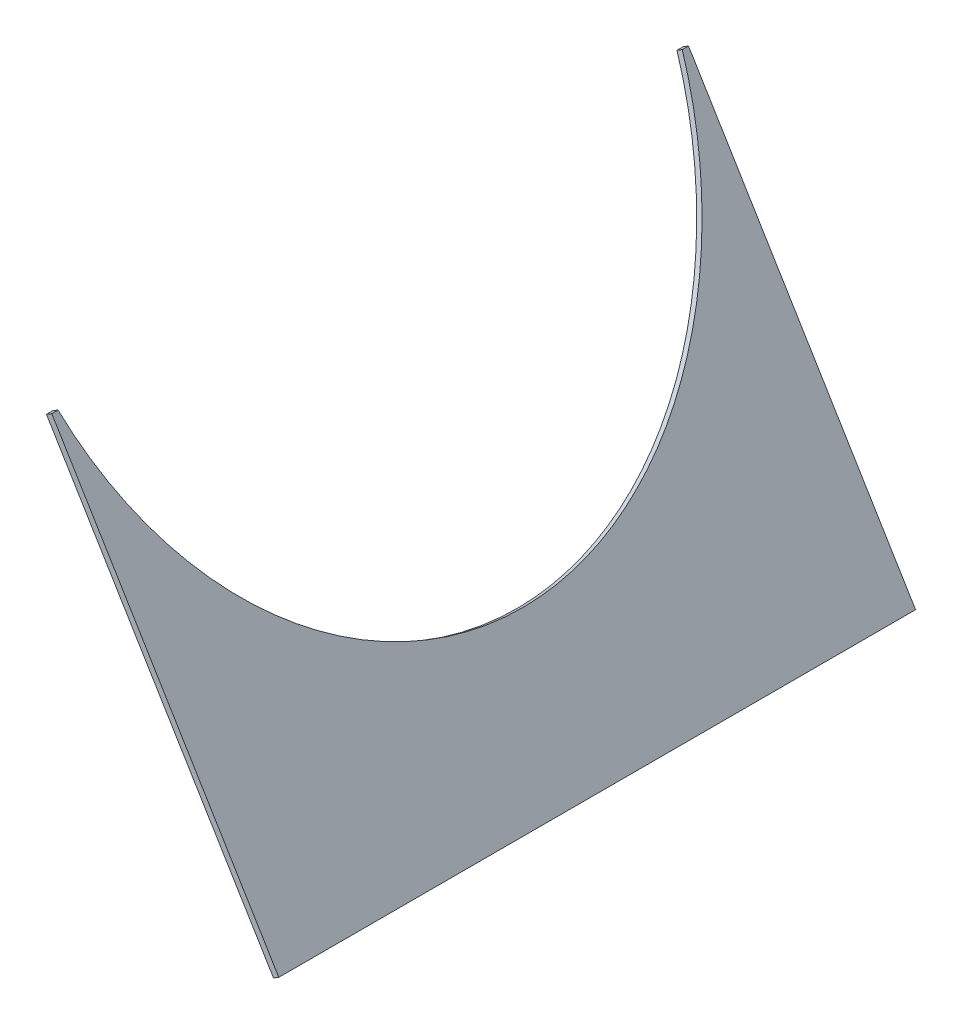
ISO-10303-21;
HEADER;
FILE_DESCRIPTION(('STEP AP214'),'2;1');
FILE_NAME('part.step','',(''),(''),'','','');
FILE_SCHEMA(('AUTOMOTIVE_DESIGN { 1 0 10303 214 1 1 1 1 }'));
ENDSEC;
DATA;
#1=APPLICATION_CONTEXT('core data for automotive mechanical design processes');
#2=APPLICATION_PROTOCOL_DEFINITION('international standard','automotive_design',2000,#1);
#3=PRODUCT_CONTEXT('',#1,'mechanical');
#4=PRODUCT('Part','Part','',(#3));
#5=PRODUCT_RELATED_PRODUCT_CATEGORY('part','',(#4));
#6=PRODUCT_DEFINITION_FORMATION('','',#4);
#7=PRODUCT_DEFINITION_CONTEXT('part definition',#1,'design');
#8=PRODUCT_DEFINITION('design','',#6,#7);
#9=PRODUCT_DEFINITION_SHAPE('','',#8);
#10=(LENGTH_UNIT() NAMED_UNIT(*) SI_UNIT(.MILLI.,.METRE.));
#11=(NAMED_UNIT(*) PLANE_ANGLE_UNIT() SI_UNIT($,.RADIAN.));
#12=(NAMED_UNIT(*) SI_UNIT($,.STERADIAN.) SOLID_ANGLE_UNIT());
#13=UNCERTAINTY_MEASURE_WITH_UNIT(LENGTH_MEASURE(1.E-05),#10,'distance_accuracy_value','');
#14=(GEOMETRIC_REPRESENTATION_CONTEXT(3) GLOBAL_UNCERTAINTY_ASSIGNED_CONTEXT((#13)) GLOBAL_UNIT_ASSIGNED_CONTEXT((#10,
#11,#12)) REPRESENTATION_CONTEXT('',''));
#15=CARTESIAN_POINT('',(0.,0.,0.));
#16=DIRECTION('',(0.,0.,1.));
#17=DIRECTION('',(1.,0.,0.));
#18=AXIS2_PLACEMENT_3D('',#15,#16,#17);
#19=CARTESIAN_POINT('',(1720.07227654078,3061.15984817426,102.));
#20=DIRECTION('',(-0.855234381676339,-0.518241403593624,0.));
#21=DIRECTION('',(0.518241403593624,-0.855234381676339,0.));
#22=AXIS2_PLACEMENT_3D('',#19,#20,#21);
#23=PLANE('',#22);
#24=DIRECTION('',(0.,0.,1.));
#25=VECTOR('',#24,1.);
#26=CARTESIAN_POINT('',(1647.33485727931,3181.19568737091,102.));
#27=LINE('',#26,#25);
#28=CARTESIAN_POINT('',(1647.33485727931,3181.19568737091,-102.));
#29=VERTEX_POINT('',#28);
#30=CARTESIAN_POINT('',(1647.33485727931,3181.19568737091,-100.));
#31=VERTEX_POINT('',#30);
#32=EDGE_CURVE('E59',#29,#31,#27,.T.);
#33=ORIENTED_EDGE('',*,*,#32,.T.);
#34=CARTESIAN_POINT('',(1633.6171020045,3203.8335852098,0.));
#35=DIRECTION('',(-0.855234381676339,-0.518241403593624,0.));
#36=DIRECTION('',(-0.518241403593624,0.855234381676339,0.));
#37=AXIS2_PLACEMENT_3D('',#34,#35,#36);
#38=ELLIPSE('',#37,120.584723294107,102.5);
#39=CARTESIAN_POINT('',(1647.33485727931,3181.19568737091,100.));
#40=VERTEX_POINT('',#39);
#41=EDGE_CURVE('E66',#31,#40,#38,.T.);
#42=ORIENTED_EDGE('',*,*,#41,.T.);
#43=DIRECTION('',(0.,0.,1.));
#44=VECTOR('',#43,1.);
#45=CARTESIAN_POINT('',(1647.33485727931,3181.19568737091,102.));
#46=LINE('',#45,#44);
#47=CARTESIAN_POINT('',(1647.33485727931,3181.19568737091,102.));
#48=VERTEX_POINT('',#47);
#49=EDGE_CURVE('E159',#40,#48,#46,.T.);
#50=ORIENTED_EDGE('',*,*,#49,.T.);
#51=DIRECTION('',(-0.518241403593624,0.855234381676339,0.));
#52=VECTOR('',#51,1.);
#53=CARTESIAN_POINT('',(1720.07227654078,3061.15984817426,102.));
#54=LINE('',#53,#52);
#55=CARTESIAN_POINT('',(1720.07227654078,3061.15984817426,102.));
#56=VERTEX_POINT('',#55);
#57=EDGE_CURVE('E128',#56,#48,#54,.T.);
#58=ORIENTED_EDGE('',*,*,#57,.F.);
#59=DIRECTION('',(0.,0.,-1.));
#60=VECTOR('',#59,1.);
#61=CARTESIAN_POINT('',(1720.07227654078,3061.15984817426,102.));
#62=LINE('',#61,#60);
#63=CARTESIAN_POINT('',(1720.07227654078,3061.15984817426,-102.));
#64=VERTEX_POINT('',#63);
#65=EDGE_CURVE('E51',#56,#64,#62,.T.);
#66=ORIENTED_EDGE('',*,*,#65,.T.);
#67=DIRECTION('',(-0.518241403593624,0.855234381676339,0.));
#68=VECTOR('',#67,1.);
#69=CARTESIAN_POINT('',(1720.07227654078,3061.15984817426,-102.));
#70=LINE('',#69,#68);
#71=EDGE_CURVE('E106',#64,#29,#70,.T.);
#72=ORIENTED_EDGE('',*,*,#71,.T.);
#73=EDGE_LOOP('',(#33,#42,#50,#58,#66,#72));
#74=FACE_BOUND('',#73,.T.);
#75=ADVANCED_FACE('F43',(#74),#23,.F.);
#76=CARTESIAN_POINT('',(1718.36180777742,3060.12336536707,102.));
#77=DIRECTION('',(-0.855234381676339,-0.518241403593624,0.));
#78=DIRECTION('',(0.518241403593624,-0.855234381676339,0.));
#79=AXIS2_PLACEMENT_3D('',#76,#77,#78);
#80=PLANE('',#79);
#81=CARTESIAN_POINT('',(1631.90663324115,3202.79710240262,0.));
#82=DIRECTION('',(-0.855234381676339,-0.518241403593624,0.));
#83=DIRECTION('',(-0.518241403593624,0.855234381676339,0.));
#84=AXIS2_PLACEMENT_3D('',#81,#82,#83);
#85=ELLIPSE('',#84,120.584723294107,102.5);
#86=CARTESIAN_POINT('',(1645.62438851596,3180.15920456373,-100.));
#87=VERTEX_POINT('',#86);
#88=CARTESIAN_POINT('',(1645.62438851596,3180.15920456373,100.));
#89=VERTEX_POINT('',#88);
#90=EDGE_CURVE('E111',#87,#89,#85,.T.);
#91=ORIENTED_EDGE('',*,*,#90,.F.);
#92=DIRECTION('',(0.,0.,1.));
#93=VECTOR('',#92,1.);
#94=CARTESIAN_POINT('',(1645.62438851596,3180.15920456373,102.));
#95=LINE('',#94,#93);
#96=CARTESIAN_POINT('',(1645.62438851596,3180.15920456373,-102.));
#97=VERTEX_POINT('',#96);
#98=EDGE_CURVE('E98',#97,#87,#95,.T.);
#99=ORIENTED_EDGE('',*,*,#98,.F.);
#100=DIRECTION('',(-0.518241403593624,0.855234381676339,0.));
#101=VECTOR('',#100,1.);
#102=CARTESIAN_POINT('',(1718.36180777742,3060.12336536707,-102.));
#103=LINE('',#102,#101);
#104=CARTESIAN_POINT('',(1718.36180777742,3060.12336536707,-102.));
#105=VERTEX_POINT('',#104);
#106=EDGE_CURVE('E113',#105,#97,#103,.T.);
#107=ORIENTED_EDGE('',*,*,#106,.F.);
#108=DIRECTION('',(0.,0.,-1.));
#109=VECTOR('',#108,1.);
#110=CARTESIAN_POINT('',(1718.36180777742,3060.12336536707,102.));
#111=LINE('',#110,#109);
#112=CARTESIAN_POINT('',(1718.36180777742,3060.12336536707,102.));
#113=VERTEX_POINT('',#112);
#114=EDGE_CURVE('E11',#113,#105,#111,.T.);
#115=ORIENTED_EDGE('',*,*,#114,.F.);
#116=DIRECTION('',(-0.518241403593624,0.855234381676339,0.));
#117=VECTOR('',#116,1.);
#118=CARTESIAN_POINT('',(1718.36180777742,3060.12336536707,102.));
#119=LINE('',#118,#117);
#120=CARTESIAN_POINT('',(1645.62438851596,3180.15920456373,102.));
#121=VERTEX_POINT('',#120);
#122=EDGE_CURVE('E182',#113,#121,#119,.T.);
#123=ORIENTED_EDGE('',*,*,#122,.T.);
#124=DIRECTION('',(0.,0.,1.));
#125=VECTOR('',#124,1.);
#126=CARTESIAN_POINT('',(1645.62438851596,3180.15920456373,102.));
#127=LINE('',#126,#125);
#128=EDGE_CURVE('E101',#89,#121,#127,.T.);
#129=ORIENTED_EDGE('',*,*,#128,.F.);
#130=EDGE_LOOP('',(#91,#99,#107,#115,#123,#129));
#131=FACE_BOUND('',#130,.T.);
#132=ADVANCED_FACE('F135',(#131),#80,.T.);
#133=CARTESIAN_POINT('',(1631.90663324115,3202.79710240262,0.));
#134=DIRECTION('',(-0.855234381676339,-0.518241403593624,0.));
#135=DIRECTION('',(-0.518241403593624,0.855234381676339,0.));
#136=AXIS2_PLACEMENT_3D('',#133,#134,#135);
#137=ELLIPSE('',#136,120.584723294107,102.5);
#138=DIRECTION('',(-0.855234381676339,-0.518241403593624,0.));
#139=VECTOR('',#138,1.);
#140=SURFACE_OF_LINEAR_EXTRUSION('',#137,#139);
#141=ORIENTED_EDGE('',*,*,#41,.F.);
#142=DIRECTION('',(-0.855234381676339,-0.518241403593624,0.));
#143=VECTOR('',#142,1.);
#144=CARTESIAN_POINT('',(1645.62438851596,3180.15920456373,-100.));
#145=LINE('',#144,#143);
#146=EDGE_CURVE('E95',#87,#31,#145,.F.);
#147=ORIENTED_EDGE('',*,*,#146,.F.);
#148=ORIENTED_EDGE('',*,*,#90,.T.);
#149=DIRECTION('',(-0.855234381676339,-0.518241403593624,0.));
#150=VECTOR('',#149,1.);
#151=CARTESIAN_POINT('',(1645.62438851596,3180.15920456373,100.));
#152=LINE('',#151,#150);
#153=EDGE_CURVE('E110',#89,#40,#152,.F.);
#154=ORIENTED_EDGE('',*,*,#153,.T.);
#155=EDGE_LOOP('',(#141,#147,#148,#154));
#156=FACE_BOUND('',#155,.T.);
#157=ADVANCED_FACE('F108',(#156),#140,.F.);
#158=CARTESIAN_POINT('',(0.,0.,-102.));
#159=DIRECTION('',(0.,0.,-1.));
#160=DIRECTION('',(-1.,0.,0.));
#161=AXIS2_PLACEMENT_3D('',#158,#159,#160);
#162=PLANE('',#161);
#163=ORIENTED_EDGE('',*,*,#106,.T.);
#164=DIRECTION('',(-0.855234381676339,-0.518241403593624,0.));
#165=VECTOR('',#164,1.);
#166=CARTESIAN_POINT('',(1645.62438851596,3180.15920456373,-102.));
#167=LINE('',#166,#165);
#168=EDGE_CURVE('E102',#97,#29,#167,.F.);
#169=ORIENTED_EDGE('',*,*,#168,.T.);
#170=ORIENTED_EDGE('',*,*,#71,.F.);
#171=DIRECTION('',(-0.85523438167636,-0.51824140359359,0.));
#172=VECTOR('',#171,1.);
#173=CARTESIAN_POINT('',(1720.07227654078,3061.15984817426,-102.));
#174=LINE('',#173,#172);
#175=EDGE_CURVE('E173',#64,#105,#174,.T.);
#176=ORIENTED_EDGE('',*,*,#175,.T.);
#177=EDGE_LOOP('',(#163,#169,#170,#176));
#178=FACE_BOUND('',#177,.T.);
#179=ADVANCED_FACE('F134',(#178),#162,.T.);
#180=CARTESIAN_POINT('',(0.,0.,102.));
#181=DIRECTION('',(0.,0.,-1.));
#182=DIRECTION('',(-1.,0.,0.));
#183=AXIS2_PLACEMENT_3D('',#180,#181,#182);
#184=PLANE('',#183);
#185=DIRECTION('',(-0.855234381676339,-0.518241403593624,0.));
#186=VECTOR('',#185,1.);
#187=CARTESIAN_POINT('',(1645.62438851596,3180.15920456373,102.));
#188=LINE('',#187,#186);
#189=EDGE_CURVE('E115',#121,#48,#188,.F.);
#190=ORIENTED_EDGE('',*,*,#189,.F.);
#191=ORIENTED_EDGE('',*,*,#122,.F.);
#192=DIRECTION('',(-0.85523438167636,-0.51824140359359,0.));
#193=VECTOR('',#192,1.);
#194=CARTESIAN_POINT('',(1720.07227654078,3061.15984817426,102.));
#195=LINE('',#194,#193);
#196=EDGE_CURVE('E178',#56,#113,#195,.T.);
#197=ORIENTED_EDGE('',*,*,#196,.F.);
#198=ORIENTED_EDGE('',*,*,#57,.T.);
#199=EDGE_LOOP('',(#190,#191,#197,#198));
#200=FACE_BOUND('',#199,.T.);
#201=ADVANCED_FACE('F138',(#200),#184,.F.);
#202=CARTESIAN_POINT('',(1720.07227654078,3061.15984817426,102.));
#203=DIRECTION('',(0.51824140359359,-0.85523438167636,0.));
#204=DIRECTION('',(0.85523438167636,0.51824140359359,0.));
#205=AXIS2_PLACEMENT_3D('',#202,#203,#204);
#206=PLANE('',#205);
#207=ORIENTED_EDGE('',*,*,#175,.F.);
#208=ORIENTED_EDGE('',*,*,#65,.F.);
#209=ORIENTED_EDGE('',*,*,#196,.T.);
#210=ORIENTED_EDGE('',*,*,#114,.T.);
#211=EDGE_LOOP('',(#207,#208,#209,#210));
#212=FACE_BOUND('',#211,.T.);
#213=ADVANCED_FACE('F141',(#212),#206,.T.);
#214=CARTESIAN_POINT('',(1645.62438851596,3180.15920456373,102.));
#215=DIRECTION('',(0.518241403593624,-0.855234381676339,0.));
#216=DIRECTION('',(0.,0.,1.));
#217=AXIS2_PLACEMENT_3D('',#214,#215,#216);
#218=PLANE('',#217);
#219=ORIENTED_EDGE('',*,*,#128,.T.);
#220=ORIENTED_EDGE('',*,*,#189,.T.);
#221=ORIENTED_EDGE('',*,*,#49,.F.);
#222=ORIENTED_EDGE('',*,*,#153,.F.);
#223=EDGE_LOOP('',(#219,#220,#221,#222));
#224=FACE_BOUND('',#223,.T.);
#225=ADVANCED_FACE('F136',(#224),#218,.F.);
#226=CARTESIAN_POINT('',(1645.62438851596,3180.15920456373,102.));
#227=DIRECTION('',(0.518241403593624,-0.855234381676339,0.));
#228=DIRECTION('',(0.,0.,1.));
#229=AXIS2_PLACEMENT_3D('',#226,#227,#228);
#230=PLANE('',#229);
#231=ORIENTED_EDGE('',*,*,#98,.T.);
#232=ORIENTED_EDGE('',*,*,#146,.T.);
#233=ORIENTED_EDGE('',*,*,#32,.F.);
#234=ORIENTED_EDGE('',*,*,#168,.F.);
#235=EDGE_LOOP('',(#231,#232,#233,#234));
#236=FACE_BOUND('',#235,.T.);
#237=ADVANCED_FACE('F96',(#236),#230,.F.);
#238=CLOSED_SHELL('',(#75,#132,#157,#179,#201,#213,#225,#237));
#239=MANIFOLD_SOLID_BREP('B2',#238);
#240=ADVANCED_BREP_SHAPE_REPRESENTATION('',(#18,#239),#14);
#241=SHAPE_DEFINITION_REPRESENTATION(#9,#240);
ENDSEC;
END-ISO-10303-21;
